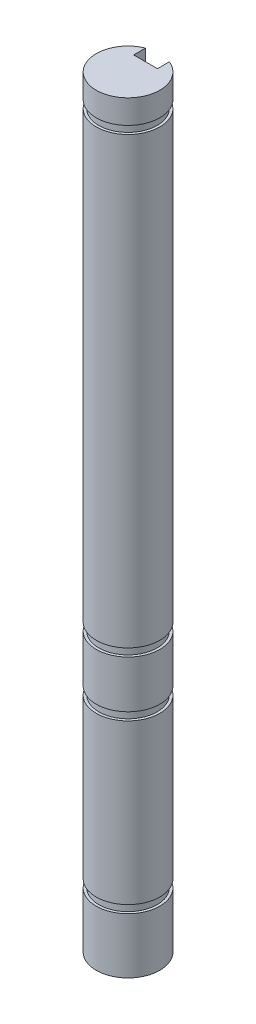
ISO-10303-21;
HEADER;
FILE_DESCRIPTION(('STEP AP214'),'2;1');
FILE_NAME('part.step','',(''),(''),'','','');
FILE_SCHEMA(('AUTOMOTIVE_DESIGN { 1 0 10303 214 1 1 1 1 }'));
ENDSEC;
DATA;
#1=APPLICATION_CONTEXT('core data for automotive mechanical design processes');
#2=APPLICATION_PROTOCOL_DEFINITION('international standard','automotive_design',2000,#1);
#3=PRODUCT_CONTEXT('',#1,'mechanical');
#4=PRODUCT('Part','Part','',(#3));
#5=PRODUCT_RELATED_PRODUCT_CATEGORY('part','',(#4));
#6=PRODUCT_DEFINITION_FORMATION('','',#4);
#7=PRODUCT_DEFINITION_CONTEXT('part definition',#1,'design');
#8=PRODUCT_DEFINITION('design','',#6,#7);
#9=PRODUCT_DEFINITION_SHAPE('','',#8);
#10=(LENGTH_UNIT() NAMED_UNIT(*) SI_UNIT(.MILLI.,.METRE.));
#11=(NAMED_UNIT(*) PLANE_ANGLE_UNIT() SI_UNIT($,.RADIAN.));
#12=(NAMED_UNIT(*) SI_UNIT($,.STERADIAN.) SOLID_ANGLE_UNIT());
#13=UNCERTAINTY_MEASURE_WITH_UNIT(LENGTH_MEASURE(1.E-05),#10,'distance_accuracy_value','');
#14=(GEOMETRIC_REPRESENTATION_CONTEXT(3) GLOBAL_UNCERTAINTY_ASSIGNED_CONTEXT((#13)) GLOBAL_UNIT_ASSIGNED_CONTEXT((#10,
#11,#12)) REPRESENTATION_CONTEXT('',''));
#15=CARTESIAN_POINT('',(0.,0.,0.));
#16=DIRECTION('',(0.,0.,1.));
#17=DIRECTION('',(1.,0.,0.));
#18=AXIS2_PLACEMENT_3D('',#15,#16,#17);
#19=CARTESIAN_POINT('',(0.,76.2,0.));
#20=DIRECTION('',(0.,-1.,0.));
#21=DIRECTION('',(0.,0.,-1.));
#22=AXIS2_PLACEMENT_3D('',#19,#20,#21);
#23=CYLINDRICAL_SURFACE('',#22,3.175);
#24=CARTESIAN_POINT('',(0.,28.575,0.));
#25=DIRECTION('',(0.,-1.,0.));
#26=DIRECTION('',(0.,0.,-1.));
#27=AXIS2_PLACEMENT_3D('',#24,#25,#26);
#28=CIRCLE('',#27,3.175);
#29=CARTESIAN_POINT('',(1.190625,28.575,-2.94330377456609));
#30=VERTEX_POINT('',#29);
#31=CARTESIAN_POINT('',(-1.190625,28.575,-2.94330377456609));
#32=VERTEX_POINT('',#31);
#33=EDGE_CURVE('E186',#30,#32,#28,.T.);
#34=ORIENTED_EDGE('',*,*,#33,.F.);
#35=DIRECTION('',(0.,-1.,0.));
#36=VECTOR('',#35,1.);
#37=CARTESIAN_POINT('',(1.190625,76.2,-2.94330377456609));
#38=LINE('',#37,#36);
#39=CARTESIAN_POINT('',(1.190625,73.025,-2.94330377456609));
#40=VERTEX_POINT('',#39);
#41=EDGE_CURVE('E290',#40,#30,#38,.T.);
#42=ORIENTED_EDGE('',*,*,#41,.F.);
#43=CARTESIAN_POINT('',(0.,73.025,0.));
#44=DIRECTION('',(0.,1.,0.));
#45=DIRECTION('',(0.,0.,1.));
#46=AXIS2_PLACEMENT_3D('',#43,#44,#45);
#47=CIRCLE('',#46,3.175);
#48=CARTESIAN_POINT('',(-1.190625,73.025,-2.94330377456609));
#49=VERTEX_POINT('',#48);
#50=EDGE_CURVE('E239',#49,#40,#47,.T.);
#51=ORIENTED_EDGE('',*,*,#50,.F.);
#52=DIRECTION('',(0.,-1.,0.));
#53=VECTOR('',#52,1.);
#54=CARTESIAN_POINT('',(-1.190625,76.2,-2.94330377456609));
#55=LINE('',#54,#53);
#56=EDGE_CURVE('E278',#49,#32,#55,.T.);
#57=ORIENTED_EDGE('',*,*,#56,.T.);
#58=EDGE_LOOP('',(#34,#42,#51,#57));
#59=FACE_BOUND('',#58,.T.);
#60=ADVANCED_FACE('F34',(#59),#23,.T.);
#61=CARTESIAN_POINT('',(1.190625,27.7876,-2.94330377456609));
#62=VERTEX_POINT('',#61);
#63=CARTESIAN_POINT('',(1.190625,23.04415,-2.94330377456609));
#64=VERTEX_POINT('',#63);
#65=EDGE_CURVE('E291',#62,#64,#38,.T.);
#66=ORIENTED_EDGE('',*,*,#65,.F.);
#67=CARTESIAN_POINT('',(0.,27.7876,0.));
#68=DIRECTION('',(0.,-1.,0.));
#69=DIRECTION('',(0.,0.,-1.));
#70=AXIS2_PLACEMENT_3D('',#67,#68,#69);
#71=CIRCLE('',#70,3.175);
#72=CARTESIAN_POINT('',(-1.190625,27.7876,-2.94330377456609));
#73=VERTEX_POINT('',#72);
#74=EDGE_CURVE('E176',#62,#73,#71,.T.);
#75=ORIENTED_EDGE('',*,*,#74,.T.);
#76=CARTESIAN_POINT('',(-1.190625,23.04415,-2.94330377456609));
#77=VERTEX_POINT('',#76);
#78=EDGE_CURVE('E279',#73,#77,#55,.T.);
#79=ORIENTED_EDGE('',*,*,#78,.T.);
#80=CARTESIAN_POINT('',(0.,23.04415,0.));
#81=DIRECTION('',(0.,-1.,0.));
#82=DIRECTION('',(0.,0.,-1.));
#83=AXIS2_PLACEMENT_3D('',#80,#81,#82);
#84=CIRCLE('',#83,3.175);
#85=EDGE_CURVE('E199',#64,#77,#84,.T.);
#86=ORIENTED_EDGE('',*,*,#85,.F.);
#87=EDGE_LOOP('',(#66,#75,#79,#86));
#88=FACE_BOUND('',#87,.T.);
#89=ADVANCED_FACE('F327',(#88),#23,.T.);
#90=CARTESIAN_POINT('',(1.190625,22.25675,-2.94330377456609));
#91=VERTEX_POINT('',#90);
#92=CARTESIAN_POINT('',(1.190625,6.35,-2.94330377456609));
#93=VERTEX_POINT('',#92);
#94=EDGE_CURVE('E330',#91,#93,#38,.T.);
#95=ORIENTED_EDGE('',*,*,#94,.F.);
#96=CARTESIAN_POINT('',(0.,22.25675,0.));
#97=DIRECTION('',(0.,-1.,0.));
#98=DIRECTION('',(0.,0.,-1.));
#99=AXIS2_PLACEMENT_3D('',#96,#97,#98);
#100=CIRCLE('',#99,3.175);
#101=CARTESIAN_POINT('',(-1.190625,22.25675,-2.94330377456609));
#102=VERTEX_POINT('',#101);
#103=EDGE_CURVE('E201',#91,#102,#100,.T.);
#104=ORIENTED_EDGE('',*,*,#103,.T.);
#105=CARTESIAN_POINT('',(-1.190625,6.35,-2.94330377456609));
#106=VERTEX_POINT('',#105);
#107=EDGE_CURVE('E344',#102,#106,#55,.T.);
#108=ORIENTED_EDGE('',*,*,#107,.T.);
#109=CARTESIAN_POINT('',(0.,6.35,0.));
#110=DIRECTION('',(0.,-1.,0.));
#111=DIRECTION('',(0.,0.,-1.));
#112=AXIS2_PLACEMENT_3D('',#109,#110,#111);
#113=CIRCLE('',#112,3.175);
#114=EDGE_CURVE('E219',#93,#106,#113,.T.);
#115=ORIENTED_EDGE('',*,*,#114,.F.);
#116=EDGE_LOOP('',(#95,#104,#108,#115));
#117=FACE_BOUND('',#116,.T.);
#118=ADVANCED_FACE('F372',(#117),#23,.T.);
#119=CARTESIAN_POINT('',(1.190625,5.5626,-2.94330377456609));
#120=VERTEX_POINT('',#119);
#121=CARTESIAN_POINT('',(1.190625,0.,-2.94330377456609));
#122=VERTEX_POINT('',#121);
#123=EDGE_CURVE('E285',#120,#122,#38,.T.);
#124=ORIENTED_EDGE('',*,*,#123,.F.);
#125=CARTESIAN_POINT('',(0.,5.5626,0.));
#126=DIRECTION('',(0.,-1.,0.));
#127=DIRECTION('',(0.,0.,-1.));
#128=AXIS2_PLACEMENT_3D('',#125,#126,#127);
#129=CIRCLE('',#128,3.175);
#130=CARTESIAN_POINT('',(-1.190625,5.5626,-2.94330377456609));
#131=VERTEX_POINT('',#130);
#132=EDGE_CURVE('E221',#120,#131,#129,.T.);
#133=ORIENTED_EDGE('',*,*,#132,.T.);
#134=CARTESIAN_POINT('',(-1.190625,0.,-2.94330377456609));
#135=VERTEX_POINT('',#134);
#136=EDGE_CURVE('E265',#131,#135,#55,.T.);
#137=ORIENTED_EDGE('',*,*,#136,.T.);
#138=CARTESIAN_POINT('',(0.,0.,0.));
#139=DIRECTION('',(0.,1.,0.));
#140=DIRECTION('',(0.,0.,1.));
#141=AXIS2_PLACEMENT_3D('',#138,#139,#140);
#142=CIRCLE('',#141,3.175);
#143=EDGE_CURVE('E254',#135,#122,#142,.T.);
#144=ORIENTED_EDGE('',*,*,#143,.T.);
#145=EDGE_LOOP('',(#124,#133,#137,#144));
#146=FACE_BOUND('',#145,.T.);
#147=ADVANCED_FACE('F342',(#146),#23,.T.);
#148=CARTESIAN_POINT('',(-1.190625,76.2,-2.94330377456609));
#149=VERTEX_POINT('',#148);
#150=CARTESIAN_POINT('',(-1.190625,73.8124,-2.94330377456609));
#151=VERTEX_POINT('',#150);
#152=EDGE_CURVE('E274',#149,#151,#55,.T.);
#153=ORIENTED_EDGE('',*,*,#152,.T.);
#154=CARTESIAN_POINT('',(0.,73.8124,0.));
#155=DIRECTION('',(0.,1.,0.));
#156=DIRECTION('',(0.,0.,1.));
#157=AXIS2_PLACEMENT_3D('',#154,#155,#156);
#158=CIRCLE('',#157,3.175);
#159=CARTESIAN_POINT('',(1.190625,73.8124,-2.94330377456609));
#160=VERTEX_POINT('',#159);
#161=EDGE_CURVE('E242',#151,#160,#158,.T.);
#162=ORIENTED_EDGE('',*,*,#161,.T.);
#163=CARTESIAN_POINT('',(1.190625,76.2,-2.94330377456609));
#164=VERTEX_POINT('',#163);
#165=EDGE_CURVE('E286',#164,#160,#38,.T.);
#166=ORIENTED_EDGE('',*,*,#165,.F.);
#167=CARTESIAN_POINT('',(0.,76.2,0.));
#168=DIRECTION('',(0.,1.,0.));
#169=DIRECTION('',(0.,0.,1.));
#170=AXIS2_PLACEMENT_3D('',#167,#168,#169);
#171=CIRCLE('',#170,3.175);
#172=EDGE_CURVE('E255',#149,#164,#171,.T.);
#173=ORIENTED_EDGE('',*,*,#172,.F.);
#174=EDGE_LOOP('',(#153,#162,#166,#173));
#175=FACE_BOUND('',#174,.T.);
#176=ADVANCED_FACE('F36',(#175),#23,.T.);
#177=CARTESIAN_POINT('',(1.190625,76.2,-1.75267877456609));
#178=DIRECTION('',(1.,0.,0.));
#179=DIRECTION('',(0.,0.,-1.));
#180=AXIS2_PLACEMENT_3D('',#177,#178,#179);
#181=PLANE('',#180);
#182=DIRECTION('',(0.,1.,0.));
#183=VECTOR('',#182,1.);
#184=CARTESIAN_POINT('',(1.190625,27.7876,-2.66733070866269));
#185=LINE('',#184,#183);
#186=CARTESIAN_POINT('',(1.190625,28.575,-2.66733070866269));
#187=VERTEX_POINT('',#186);
#188=CARTESIAN_POINT('',(1.190625,27.7876,-2.66733070866269));
#189=VERTEX_POINT('',#188);
#190=EDGE_CURVE('E183',#187,#189,#185,.F.);
#191=ORIENTED_EDGE('',*,*,#190,.T.);
#192=DIRECTION('',(0.,0.,-1.));
#193=VECTOR('',#192,1.);
#194=CARTESIAN_POINT('',(1.190625,27.7876,-1.75267877456609));
#195=LINE('',#194,#193);
#196=EDGE_CURVE('E171',#189,#62,#195,.T.);
#197=ORIENTED_EDGE('',*,*,#196,.T.);
#198=ORIENTED_EDGE('',*,*,#65,.T.);
#199=DIRECTION('',(0.,0.,-1.));
#200=VECTOR('',#199,1.);
#201=CARTESIAN_POINT('',(1.190625,23.04415,-1.75267877456609));
#202=LINE('',#201,#200);
#203=CARTESIAN_POINT('',(1.190625,23.04415,-2.66733070866269));
#204=VERTEX_POINT('',#203);
#205=EDGE_CURVE('E209',#204,#64,#202,.T.);
#206=ORIENTED_EDGE('',*,*,#205,.F.);
#207=DIRECTION('',(0.,1.,0.));
#208=VECTOR('',#207,1.);
#209=CARTESIAN_POINT('',(1.190625,22.25675,-2.66733070866269));
#210=LINE('',#209,#208);
#211=CARTESIAN_POINT('',(1.190625,22.25675,-2.66733070866269));
#212=VERTEX_POINT('',#211);
#213=EDGE_CURVE('E204',#204,#212,#210,.F.);
#214=ORIENTED_EDGE('',*,*,#213,.T.);
#215=DIRECTION('',(0.,0.,-1.));
#216=VECTOR('',#215,1.);
#217=CARTESIAN_POINT('',(1.190625,22.25675,-1.75267877456609));
#218=LINE('',#217,#216);
#219=EDGE_CURVE('E212',#212,#91,#218,.T.);
#220=ORIENTED_EDGE('',*,*,#219,.T.);
#221=ORIENTED_EDGE('',*,*,#94,.T.);
#222=DIRECTION('',(0.,0.,-1.));
#223=VECTOR('',#222,1.);
#224=CARTESIAN_POINT('',(1.190625,6.34999999999999,-1.75267877456609));
#225=LINE('',#224,#223);
#226=CARTESIAN_POINT('',(1.190625,6.35,-2.66733070866269));
#227=VERTEX_POINT('',#226);
#228=EDGE_CURVE('E229',#227,#93,#225,.T.);
#229=ORIENTED_EDGE('',*,*,#228,.F.);
#230=DIRECTION('',(0.,1.,0.));
#231=VECTOR('',#230,1.);
#232=CARTESIAN_POINT('',(1.190625,5.5626,-2.66733070866269));
#233=LINE('',#232,#231);
#234=CARTESIAN_POINT('',(1.190625,5.5626,-2.66733070866269));
#235=VERTEX_POINT('',#234);
#236=EDGE_CURVE('E224',#227,#235,#233,.F.);
#237=ORIENTED_EDGE('',*,*,#236,.T.);
#238=DIRECTION('',(0.,0.,-1.));
#239=VECTOR('',#238,1.);
#240=CARTESIAN_POINT('',(1.190625,5.5626,-1.75267877456609));
#241=LINE('',#240,#239);
#242=EDGE_CURVE('E232',#235,#120,#241,.T.);
#243=ORIENTED_EDGE('',*,*,#242,.T.);
#244=ORIENTED_EDGE('',*,*,#123,.T.);
#245=DIRECTION('',(0.,0.,1.));
#246=VECTOR('',#245,1.);
#247=CARTESIAN_POINT('',(1.190625,0.,-1.75267877456609));
#248=LINE('',#247,#246);
#249=CARTESIAN_POINT('',(1.190625,0.,-1.75267877456609));
#250=VERTEX_POINT('',#249);
#251=EDGE_CURVE('E268',#122,#250,#248,.T.);
#252=ORIENTED_EDGE('',*,*,#251,.T.);
#253=DIRECTION('',(0.,-1.,0.));
#254=VECTOR('',#253,1.);
#255=CARTESIAN_POINT('',(1.190625,76.2,-1.75267877456609));
#256=LINE('',#255,#254);
#257=CARTESIAN_POINT('',(1.190625,76.2,-1.75267877456609));
#258=VERTEX_POINT('',#257);
#259=EDGE_CURVE('E282',#258,#250,#256,.T.);
#260=ORIENTED_EDGE('',*,*,#259,.F.);
#261=DIRECTION('',(0.,0.,1.));
#262=VECTOR('',#261,1.);
#263=CARTESIAN_POINT('',(1.190625,76.2,-1.75267877456609));
#264=LINE('',#263,#262);
#265=EDGE_CURVE('E258',#164,#258,#264,.T.);
#266=ORIENTED_EDGE('',*,*,#265,.F.);
#267=ORIENTED_EDGE('',*,*,#165,.T.);
#268=DIRECTION('',(0.,0.,1.));
#269=VECTOR('',#268,1.);
#270=CARTESIAN_POINT('',(1.190625,73.8124,-1.75267877456609));
#271=LINE('',#270,#269);
#272=CARTESIAN_POINT('',(1.190625,73.8124,-2.66733070866269));
#273=VERTEX_POINT('',#272);
#274=EDGE_CURVE('E251',#160,#273,#271,.T.);
#275=ORIENTED_EDGE('',*,*,#274,.T.);
#276=DIRECTION('',(0.,-1.,0.));
#277=VECTOR('',#276,1.);
#278=CARTESIAN_POINT('',(1.190625,73.8124,-2.66733070866269));
#279=LINE('',#278,#277);
#280=CARTESIAN_POINT('',(1.190625,73.025,-2.66733070866269));
#281=VERTEX_POINT('',#280);
#282=EDGE_CURVE('E245',#273,#281,#279,.T.);
#283=ORIENTED_EDGE('',*,*,#282,.T.);
#284=DIRECTION('',(0.,0.,1.));
#285=VECTOR('',#284,1.);
#286=CARTESIAN_POINT('',(1.190625,73.025,-1.75267877456609));
#287=LINE('',#286,#285);
#288=EDGE_CURVE('E249',#40,#281,#287,.T.);
#289=ORIENTED_EDGE('',*,*,#288,.F.);
#290=ORIENTED_EDGE('',*,*,#41,.T.);
#291=DIRECTION('',(0.,0.,-1.));
#292=VECTOR('',#291,1.);
#293=CARTESIAN_POINT('',(1.190625,28.575,-1.75267877456609));
#294=LINE('',#293,#292);
#295=EDGE_CURVE('E180',#187,#30,#294,.T.);
#296=ORIENTED_EDGE('',*,*,#295,.F.);
#297=EDGE_LOOP('',(#191,#197,#198,#206,#214,#220,#221,#229,#237,#243,#244,#252,#260,#266,#267,
#275,#283,#289,#290,#296));
#298=FACE_BOUND('',#297,.T.);
#299=ADVANCED_FACE('F189',(#298),#181,.F.);
#300=CARTESIAN_POINT('',(-1.190625,76.2,-1.75267877456609));
#301=DIRECTION('',(0.,0.,1.));
#302=DIRECTION('',(1.,0.,0.));
#303=AXIS2_PLACEMENT_3D('',#300,#301,#302);
#304=PLANE('',#303);
#305=DIRECTION('',(-1.,0.,0.));
#306=VECTOR('',#305,1.);
#307=CARTESIAN_POINT('',(-1.190625,0.,-1.75267877456609));
#308=LINE('',#307,#306);
#309=CARTESIAN_POINT('',(-1.190625,0.,-1.75267877456609));
#310=VERTEX_POINT('',#309);
#311=EDGE_CURVE('E270',#250,#310,#308,.T.);
#312=ORIENTED_EDGE('',*,*,#311,.T.);
#313=DIRECTION('',(0.,-1.,0.));
#314=VECTOR('',#313,1.);
#315=CARTESIAN_POINT('',(-1.190625,76.2,-1.75267877456609));
#316=LINE('',#315,#314);
#317=CARTESIAN_POINT('',(-1.190625,76.2,-1.75267877456609));
#318=VERTEX_POINT('',#317);
#319=EDGE_CURVE('E277',#318,#310,#316,.T.);
#320=ORIENTED_EDGE('',*,*,#319,.F.);
#321=DIRECTION('',(-1.,0.,0.));
#322=VECTOR('',#321,1.);
#323=CARTESIAN_POINT('',(-1.190625,76.2,-1.75267877456609));
#324=LINE('',#323,#322);
#325=EDGE_CURVE('E261',#258,#318,#324,.T.);
#326=ORIENTED_EDGE('',*,*,#325,.F.);
#327=ORIENTED_EDGE('',*,*,#259,.T.);
#328=EDGE_LOOP('',(#312,#320,#326,#327));
#329=FACE_BOUND('',#328,.T.);
#330=ADVANCED_FACE('F350',(#329),#304,.F.);
#331=CARTESIAN_POINT('',(-1.190625,76.2,-2.94330377456609));
#332=DIRECTION('',(-1.,0.,0.));
#333=DIRECTION('',(0.,0.,1.));
#334=AXIS2_PLACEMENT_3D('',#331,#332,#333);
#335=PLANE('',#334);
#336=ORIENTED_EDGE('',*,*,#78,.F.);
#337=DIRECTION('',(0.,0.,1.));
#338=VECTOR('',#337,1.);
#339=CARTESIAN_POINT('',(-1.190625,27.7876,-2.94330377456609));
#340=LINE('',#339,#338);
#341=CARTESIAN_POINT('',(-1.190625,27.7876,-2.66733070866269));
#342=VERTEX_POINT('',#341);
#343=EDGE_CURVE('E11',#73,#342,#340,.T.);
#344=ORIENTED_EDGE('',*,*,#343,.T.);
#345=DIRECTION('',(0.,1.,0.));
#346=VECTOR('',#345,1.);
#347=CARTESIAN_POINT('',(-1.190625,27.7876,-2.66733070866269));
#348=LINE('',#347,#346);
#349=CARTESIAN_POINT('',(-1.190625,28.575,-2.66733070866269));
#350=VERTEX_POINT('',#349);
#351=EDGE_CURVE('E185',#342,#350,#348,.T.);
#352=ORIENTED_EDGE('',*,*,#351,.T.);
#353=DIRECTION('',(0.,0.,1.));
#354=VECTOR('',#353,1.);
#355=CARTESIAN_POINT('',(-1.190625,28.575,-2.94330377456609));
#356=LINE('',#355,#354);
#357=EDGE_CURVE('E42',#32,#350,#356,.T.);
#358=ORIENTED_EDGE('',*,*,#357,.F.);
#359=ORIENTED_EDGE('',*,*,#56,.F.);
#360=DIRECTION('',(0.,0.,-1.));
#361=VECTOR('',#360,1.);
#362=CARTESIAN_POINT('',(-1.190625,73.025,-2.94330377456609));
#363=LINE('',#362,#361);
#364=CARTESIAN_POINT('',(-1.190625,73.025,-2.66733070866269));
#365=VERTEX_POINT('',#364);
#366=EDGE_CURVE('E294',#365,#49,#363,.T.);
#367=ORIENTED_EDGE('',*,*,#366,.F.);
#368=DIRECTION('',(0.,-1.,0.));
#369=VECTOR('',#368,1.);
#370=CARTESIAN_POINT('',(-1.190625,73.8124,-2.66733070866269));
#371=LINE('',#370,#369);
#372=CARTESIAN_POINT('',(-1.190625,73.8124,-2.66733070866269));
#373=VERTEX_POINT('',#372);
#374=EDGE_CURVE('E289',#365,#373,#371,.F.);
#375=ORIENTED_EDGE('',*,*,#374,.T.);
#376=DIRECTION('',(0.,0.,-1.));
#377=VECTOR('',#376,1.);
#378=CARTESIAN_POINT('',(-1.190625,73.8124,-2.94330377456609));
#379=LINE('',#378,#377);
#380=EDGE_CURVE('E296',#373,#151,#379,.T.);
#381=ORIENTED_EDGE('',*,*,#380,.T.);
#382=ORIENTED_EDGE('',*,*,#152,.F.);
#383=DIRECTION('',(0.,0.,-1.));
#384=VECTOR('',#383,1.);
#385=CARTESIAN_POINT('',(-1.190625,76.2,-2.94330377456609));
#386=LINE('',#385,#384);
#387=EDGE_CURVE('E263',#318,#149,#386,.T.);
#388=ORIENTED_EDGE('',*,*,#387,.F.);
#389=ORIENTED_EDGE('',*,*,#319,.T.);
#390=DIRECTION('',(0.,0.,-1.));
#391=VECTOR('',#390,1.);
#392=CARTESIAN_POINT('',(-1.190625,0.,-2.94330377456609));
#393=LINE('',#392,#391);
#394=EDGE_CURVE('E259',#310,#135,#393,.T.);
#395=ORIENTED_EDGE('',*,*,#394,.T.);
#396=ORIENTED_EDGE('',*,*,#136,.F.);
#397=DIRECTION('',(0.,0.,1.));
#398=VECTOR('',#397,1.);
#399=CARTESIAN_POINT('',(-1.190625,5.5626,-2.94330377456609));
#400=LINE('',#399,#398);
#401=CARTESIAN_POINT('',(-1.190625,5.5626,-2.66733070866269));
#402=VERTEX_POINT('',#401);
#403=EDGE_CURVE('E305',#131,#402,#400,.T.);
#404=ORIENTED_EDGE('',*,*,#403,.T.);
#405=DIRECTION('',(0.,1.,0.));
#406=VECTOR('',#405,1.);
#407=CARTESIAN_POINT('',(-1.190625,5.5626,-2.66733070866269));
#408=LINE('',#407,#406);
#409=CARTESIAN_POINT('',(-1.190625,6.35,-2.66733070866269));
#410=VERTEX_POINT('',#409);
#411=EDGE_CURVE('E299',#402,#410,#408,.T.);
#412=ORIENTED_EDGE('',*,*,#411,.T.);
#413=DIRECTION('',(0.,0.,1.));
#414=VECTOR('',#413,1.);
#415=CARTESIAN_POINT('',(-1.190625,6.34999999999999,-2.94330377456609));
#416=LINE('',#415,#414);
#417=EDGE_CURVE('E302',#106,#410,#416,.T.);
#418=ORIENTED_EDGE('',*,*,#417,.F.);
#419=ORIENTED_EDGE('',*,*,#107,.F.);
#420=DIRECTION('',(0.,0.,1.));
#421=VECTOR('',#420,1.);
#422=CARTESIAN_POINT('',(-1.190625,22.25675,-2.94330377456609));
#423=LINE('',#422,#421);
#424=CARTESIAN_POINT('',(-1.190625,22.25675,-2.66733070866269));
#425=VERTEX_POINT('',#424);
#426=EDGE_CURVE('E313',#102,#425,#423,.T.);
#427=ORIENTED_EDGE('',*,*,#426,.T.);
#428=DIRECTION('',(0.,1.,0.));
#429=VECTOR('',#428,1.);
#430=CARTESIAN_POINT('',(-1.190625,22.25675,-2.66733070866269));
#431=LINE('',#430,#429);
#432=CARTESIAN_POINT('',(-1.190625,23.04415,-2.66733070866269));
#433=VERTEX_POINT('',#432);
#434=EDGE_CURVE('E308',#425,#433,#431,.T.);
#435=ORIENTED_EDGE('',*,*,#434,.T.);
#436=DIRECTION('',(0.,0.,1.));
#437=VECTOR('',#436,1.);
#438=CARTESIAN_POINT('',(-1.190625,23.04415,-2.94330377456609));
#439=LINE('',#438,#437);
#440=EDGE_CURVE('E311',#77,#433,#439,.T.);
#441=ORIENTED_EDGE('',*,*,#440,.F.);
#442=EDGE_LOOP('',(#336,#344,#352,#358,#359,#367,#375,#381,#382,#388,#389,#395,#396,#404,#412,
#418,#419,#427,#435,#441));
#443=FACE_BOUND('',#442,.T.);
#444=ADVANCED_FACE('F324',(#443),#335,.F.);
#445=CARTESIAN_POINT('',(0.,76.2,0.));
#446=DIRECTION('',(0.,1.,0.));
#447=DIRECTION('',(0.,0.,1.));
#448=AXIS2_PLACEMENT_3D('',#445,#446,#447);
#449=PLANE('',#448);
#450=ORIENTED_EDGE('',*,*,#172,.T.);
#451=ORIENTED_EDGE('',*,*,#265,.T.);
#452=ORIENTED_EDGE('',*,*,#325,.T.);
#453=ORIENTED_EDGE('',*,*,#387,.T.);
#454=EDGE_LOOP('',(#450,#451,#452,#453));
#455=FACE_BOUND('',#454,.T.);
#456=ADVANCED_FACE('F354',(#455),#449,.T.);
#457=CARTESIAN_POINT('',(0.,0.,0.));
#458=DIRECTION('',(0.,1.,0.));
#459=DIRECTION('',(0.,0.,1.));
#460=AXIS2_PLACEMENT_3D('',#457,#458,#459);
#461=PLANE('',#460);
#462=ORIENTED_EDGE('',*,*,#143,.F.);
#463=ORIENTED_EDGE('',*,*,#394,.F.);
#464=ORIENTED_EDGE('',*,*,#311,.F.);
#465=ORIENTED_EDGE('',*,*,#251,.F.);
#466=EDGE_LOOP('',(#462,#463,#464,#465));
#467=FACE_BOUND('',#466,.T.);
#468=ADVANCED_FACE('F340',(#467),#461,.F.);
#469=CARTESIAN_POINT('',(0.,73.8124,0.));
#470=DIRECTION('',(0.,1.,0.));
#471=DIRECTION('',(0.,0.,1.));
#472=AXIS2_PLACEMENT_3D('',#469,#470,#471);
#473=PLANE('',#472);
#474=ORIENTED_EDGE('',*,*,#161,.F.);
#475=ORIENTED_EDGE('',*,*,#380,.F.);
#476=CARTESIAN_POINT('',(0.,73.8124,0.));
#477=DIRECTION('',(0.,1.,0.));
#478=DIRECTION('',(0.,0.,1.));
#479=AXIS2_PLACEMENT_3D('',#476,#477,#478);
#480=CIRCLE('',#479,2.921);
#481=EDGE_CURVE('E236',#373,#273,#480,.T.);
#482=ORIENTED_EDGE('',*,*,#481,.T.);
#483=ORIENTED_EDGE('',*,*,#274,.F.);
#484=EDGE_LOOP('',(#474,#475,#482,#483));
#485=FACE_BOUND('',#484,.T.);
#486=ADVANCED_FACE('F358',(#485),#473,.F.);
#487=CARTESIAN_POINT('',(0.,73.025,0.));
#488=DIRECTION('',(0.,1.,0.));
#489=DIRECTION('',(0.,0.,1.));
#490=AXIS2_PLACEMENT_3D('',#487,#488,#489);
#491=PLANE('',#490);
#492=ORIENTED_EDGE('',*,*,#288,.T.);
#493=CARTESIAN_POINT('',(0.,73.025,0.));
#494=DIRECTION('',(0.,1.,0.));
#495=DIRECTION('',(0.,0.,1.));
#496=AXIS2_PLACEMENT_3D('',#493,#494,#495);
#497=CIRCLE('',#496,2.921);
#498=EDGE_CURVE('E235',#365,#281,#497,.T.);
#499=ORIENTED_EDGE('',*,*,#498,.F.);
#500=ORIENTED_EDGE('',*,*,#366,.T.);
#501=ORIENTED_EDGE('',*,*,#50,.T.);
#502=EDGE_LOOP('',(#492,#499,#500,#501));
#503=FACE_BOUND('',#502,.T.);
#504=ADVANCED_FACE('F364',(#503),#491,.T.);
#505=CARTESIAN_POINT('',(0.,73.8124,0.));
#506=DIRECTION('',(0.,-1.,0.));
#507=DIRECTION('',(0.,0.,-1.));
#508=AXIS2_PLACEMENT_3D('',#505,#506,#507);
#509=CYLINDRICAL_SURFACE('',#508,2.921);
#510=ORIENTED_EDGE('',*,*,#481,.F.);
#511=ORIENTED_EDGE('',*,*,#374,.F.);
#512=ORIENTED_EDGE('',*,*,#498,.T.);
#513=ORIENTED_EDGE('',*,*,#282,.F.);
#514=EDGE_LOOP('',(#510,#511,#512,#513));
#515=FACE_BOUND('',#514,.T.);
#516=ADVANCED_FACE('F362',(#515),#509,.T.);
#517=CARTESIAN_POINT('',(0.,5.5626,0.));
#518=DIRECTION('',(0.,-1.,0.));
#519=DIRECTION('',(0.,0.,-1.));
#520=AXIS2_PLACEMENT_3D('',#517,#518,#519);
#521=PLANE('',#520);
#522=CARTESIAN_POINT('',(0.,5.5626,0.));
#523=DIRECTION('',(0.,-1.,0.));
#524=DIRECTION('',(0.,0.,-1.));
#525=AXIS2_PLACEMENT_3D('',#522,#523,#524);
#526=CIRCLE('',#525,2.921);
#527=EDGE_CURVE('E216',#235,#402,#526,.T.);
#528=ORIENTED_EDGE('',*,*,#527,.T.);
#529=ORIENTED_EDGE('',*,*,#403,.F.);
#530=ORIENTED_EDGE('',*,*,#132,.F.);
#531=ORIENTED_EDGE('',*,*,#242,.F.);
#532=EDGE_LOOP('',(#528,#529,#530,#531));
#533=FACE_BOUND('',#532,.T.);
#534=ADVANCED_FACE('F381',(#533),#521,.F.);
#535=CARTESIAN_POINT('',(0.,6.35,0.));
#536=DIRECTION('',(0.,-1.,0.));
#537=DIRECTION('',(0.,0.,-1.));
#538=AXIS2_PLACEMENT_3D('',#535,#536,#537);
#539=PLANE('',#538);
#540=ORIENTED_EDGE('',*,*,#228,.T.);
#541=ORIENTED_EDGE('',*,*,#114,.T.);
#542=ORIENTED_EDGE('',*,*,#417,.T.);
#543=CARTESIAN_POINT('',(0.,6.35,0.));
#544=DIRECTION('',(0.,-1.,0.));
#545=DIRECTION('',(0.,0.,-1.));
#546=AXIS2_PLACEMENT_3D('',#543,#544,#545);
#547=CIRCLE('',#546,2.921);
#548=EDGE_CURVE('E215',#227,#410,#547,.T.);
#549=ORIENTED_EDGE('',*,*,#548,.F.);
#550=EDGE_LOOP('',(#540,#541,#542,#549));
#551=FACE_BOUND('',#550,.T.);
#552=ADVANCED_FACE('F375',(#551),#539,.T.);
#553=CARTESIAN_POINT('',(0.,5.5626,0.));
#554=DIRECTION('',(0.,1.,0.));
#555=DIRECTION('',(0.,0.,1.));
#556=AXIS2_PLACEMENT_3D('',#553,#554,#555);
#557=CYLINDRICAL_SURFACE('',#556,2.921);
#558=ORIENTED_EDGE('',*,*,#548,.T.);
#559=ORIENTED_EDGE('',*,*,#411,.F.);
#560=ORIENTED_EDGE('',*,*,#527,.F.);
#561=ORIENTED_EDGE('',*,*,#236,.F.);
#562=EDGE_LOOP('',(#558,#559,#560,#561));
#563=FACE_BOUND('',#562,.T.);
#564=ADVANCED_FACE('F379',(#563),#557,.T.);
#565=CARTESIAN_POINT('',(0.,22.25675,0.));
#566=DIRECTION('',(0.,-1.,0.));
#567=DIRECTION('',(0.,0.,-1.));
#568=AXIS2_PLACEMENT_3D('',#565,#566,#567);
#569=PLANE('',#568);
#570=CARTESIAN_POINT('',(0.,22.25675,0.));
#571=DIRECTION('',(0.,-1.,0.));
#572=DIRECTION('',(0.,0.,-1.));
#573=AXIS2_PLACEMENT_3D('',#570,#571,#572);
#574=CIRCLE('',#573,2.921);
#575=EDGE_CURVE('E196',#212,#425,#574,.T.);
#576=ORIENTED_EDGE('',*,*,#575,.T.);
#577=ORIENTED_EDGE('',*,*,#426,.F.);
#578=ORIENTED_EDGE('',*,*,#103,.F.);
#579=ORIENTED_EDGE('',*,*,#219,.F.);
#580=EDGE_LOOP('',(#576,#577,#578,#579));
#581=FACE_BOUND('',#580,.T.);
#582=ADVANCED_FACE('F468',(#581),#569,.F.);
#583=CARTESIAN_POINT('',(0.,23.04415,0.));
#584=DIRECTION('',(0.,-1.,0.));
#585=DIRECTION('',(0.,0.,-1.));
#586=AXIS2_PLACEMENT_3D('',#583,#584,#585);
#587=PLANE('',#586);
#588=ORIENTED_EDGE('',*,*,#205,.T.);
#589=ORIENTED_EDGE('',*,*,#85,.T.);
#590=ORIENTED_EDGE('',*,*,#440,.T.);
#591=CARTESIAN_POINT('',(0.,23.04415,0.));
#592=DIRECTION('',(0.,-1.,0.));
#593=DIRECTION('',(0.,0.,-1.));
#594=AXIS2_PLACEMENT_3D('',#591,#592,#593);
#595=CIRCLE('',#594,2.921);
#596=EDGE_CURVE('E57',#204,#433,#595,.T.);
#597=ORIENTED_EDGE('',*,*,#596,.F.);
#598=EDGE_LOOP('',(#588,#589,#590,#597));
#599=FACE_BOUND('',#598,.T.);
#600=ADVANCED_FACE('F467',(#599),#587,.T.);
#601=CARTESIAN_POINT('',(0.,22.25675,0.));
#602=DIRECTION('',(0.,1.,0.));
#603=DIRECTION('',(0.,0.,1.));
#604=AXIS2_PLACEMENT_3D('',#601,#602,#603);
#605=CYLINDRICAL_SURFACE('',#604,2.921);
#606=ORIENTED_EDGE('',*,*,#596,.T.);
#607=ORIENTED_EDGE('',*,*,#434,.F.);
#608=ORIENTED_EDGE('',*,*,#575,.F.);
#609=ORIENTED_EDGE('',*,*,#213,.F.);
#610=EDGE_LOOP('',(#606,#607,#608,#609));
#611=FACE_BOUND('',#610,.T.);
#612=ADVANCED_FACE('F444',(#611),#605,.T.);
#613=CARTESIAN_POINT('',(0.,27.7876,0.));
#614=DIRECTION('',(0.,-1.,0.));
#615=DIRECTION('',(0.,0.,-1.));
#616=AXIS2_PLACEMENT_3D('',#613,#614,#615);
#617=PLANE('',#616);
#618=CARTESIAN_POINT('',(0.,27.7876,0.));
#619=DIRECTION('',(0.,-1.,0.));
#620=DIRECTION('',(0.,0.,-1.));
#621=AXIS2_PLACEMENT_3D('',#618,#619,#620);
#622=CIRCLE('',#621,2.921);
#623=EDGE_CURVE('E174',#189,#342,#622,.T.);
#624=ORIENTED_EDGE('',*,*,#623,.T.);
#625=ORIENTED_EDGE('',*,*,#343,.F.);
#626=ORIENTED_EDGE('',*,*,#74,.F.);
#627=ORIENTED_EDGE('',*,*,#196,.F.);
#628=EDGE_LOOP('',(#624,#625,#626,#627));
#629=FACE_BOUND('',#628,.T.);
#630=ADVANCED_FACE('F173',(#629),#617,.F.);
#631=CARTESIAN_POINT('',(0.,28.575,0.));
#632=DIRECTION('',(0.,-1.,0.));
#633=DIRECTION('',(0.,0.,-1.));
#634=AXIS2_PLACEMENT_3D('',#631,#632,#633);
#635=PLANE('',#634);
#636=ORIENTED_EDGE('',*,*,#295,.T.);
#637=ORIENTED_EDGE('',*,*,#33,.T.);
#638=ORIENTED_EDGE('',*,*,#357,.T.);
#639=CARTESIAN_POINT('',(0.,28.575,0.));
#640=DIRECTION('',(0.,-1.,0.));
#641=DIRECTION('',(0.,0.,-1.));
#642=AXIS2_PLACEMENT_3D('',#639,#640,#641);
#643=CIRCLE('',#642,2.921);
#644=EDGE_CURVE('E49',#187,#350,#643,.T.);
#645=ORIENTED_EDGE('',*,*,#644,.F.);
#646=EDGE_LOOP('',(#636,#637,#638,#645));
#647=FACE_BOUND('',#646,.T.);
#648=ADVANCED_FACE('F318',(#647),#635,.T.);
#649=CARTESIAN_POINT('',(0.,27.7876,0.));
#650=DIRECTION('',(0.,1.,0.));
#651=DIRECTION('',(0.,0.,1.));
#652=AXIS2_PLACEMENT_3D('',#649,#650,#651);
#653=CYLINDRICAL_SURFACE('',#652,2.921);
#654=ORIENTED_EDGE('',*,*,#644,.T.);
#655=ORIENTED_EDGE('',*,*,#351,.F.);
#656=ORIENTED_EDGE('',*,*,#623,.F.);
#657=ORIENTED_EDGE('',*,*,#190,.F.);
#658=EDGE_LOOP('',(#654,#655,#656,#657));
#659=FACE_BOUND('',#658,.T.);
#660=ADVANCED_FACE('F182',(#659),#653,.T.);
#661=CLOSED_SHELL('',(#60,#89,#118,#147,#176,#299,#330,#444,#456,#468,#486,#504,#516,#534,#552,
#564,#582,#600,#612,#630,#648,#660));
#662=MANIFOLD_SOLID_BREP('B2',#661);
#663=ADVANCED_BREP_SHAPE_REPRESENTATION('',(#18,#662),#14);
#664=SHAPE_DEFINITION_REPRESENTATION(#9,#663);
ENDSEC;
END-ISO-10303-21;
